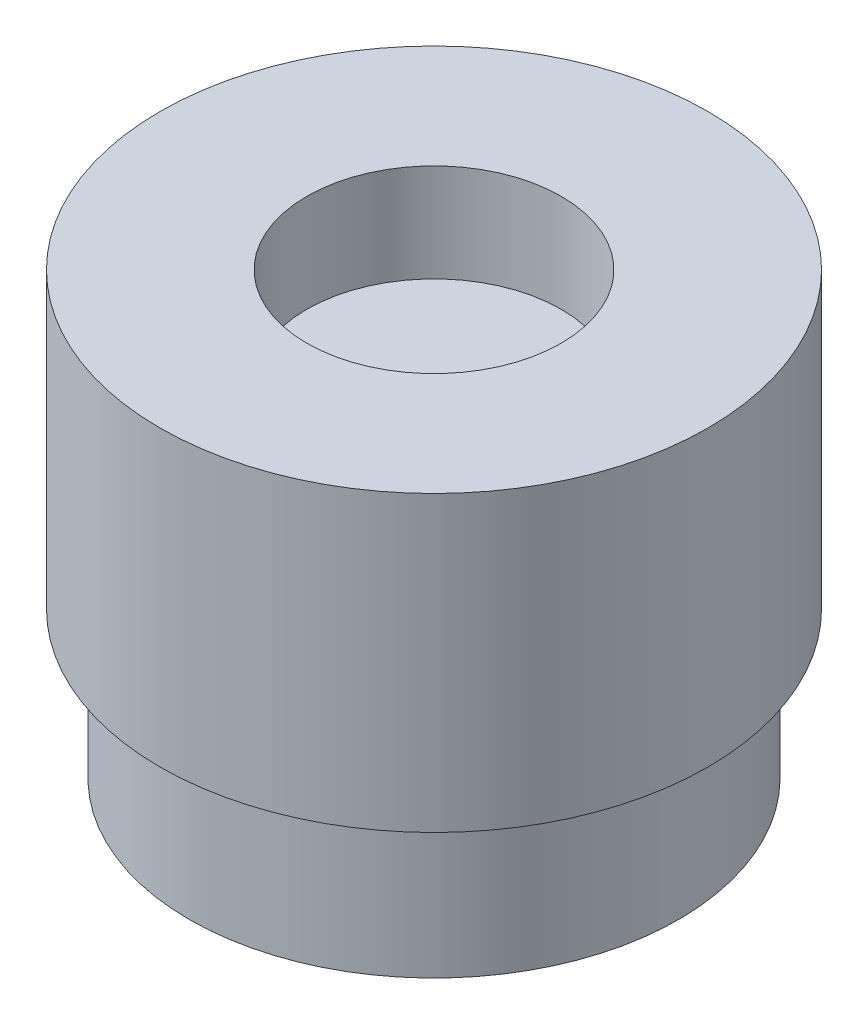
ISO-10303-21;
HEADER;
FILE_DESCRIPTION(('STEP AP214'),'2;1');
FILE_NAME('part.step','',(''),(''),'','','');
FILE_SCHEMA(('AUTOMOTIVE_DESIGN { 1 0 10303 214 1 1 1 1 }'));
ENDSEC;
DATA;
#1=APPLICATION_CONTEXT('core data for automotive mechanical design processes');
#2=APPLICATION_PROTOCOL_DEFINITION('international standard','automotive_design',2000,#1);
#3=PRODUCT_CONTEXT('',#1,'mechanical');
#4=PRODUCT('Part','Part','',(#3));
#5=PRODUCT_RELATED_PRODUCT_CATEGORY('part','',(#4));
#6=PRODUCT_DEFINITION_FORMATION('','',#4);
#7=PRODUCT_DEFINITION_CONTEXT('part definition',#1,'design');
#8=PRODUCT_DEFINITION('design','',#6,#7);
#9=PRODUCT_DEFINITION_SHAPE('','',#8);
#10=(LENGTH_UNIT() NAMED_UNIT(*) SI_UNIT(.MILLI.,.METRE.));
#11=(NAMED_UNIT(*) PLANE_ANGLE_UNIT() SI_UNIT($,.RADIAN.));
#12=(NAMED_UNIT(*) SI_UNIT($,.STERADIAN.) SOLID_ANGLE_UNIT());
#13=UNCERTAINTY_MEASURE_WITH_UNIT(LENGTH_MEASURE(1.E-05),#10,'distance_accuracy_value','');
#14=(GEOMETRIC_REPRESENTATION_CONTEXT(3) GLOBAL_UNCERTAINTY_ASSIGNED_CONTEXT((#13)) GLOBAL_UNIT_ASSIGNED_CONTEXT((#10,
#11,#12)) REPRESENTATION_CONTEXT('',''));
#15=CARTESIAN_POINT('',(0.,0.,0.));
#16=DIRECTION('',(0.,0.,1.));
#17=DIRECTION('',(1.,0.,0.));
#18=AXIS2_PLACEMENT_3D('',#15,#16,#17);
#19=CARTESIAN_POINT('',(0.,3.,0.));
#20=DIRECTION('',(0.,1.,0.));
#21=DIRECTION('',(0.,0.,1.));
#22=AXIS2_PLACEMENT_3D('',#19,#20,#21);
#23=PLANE('',#22);
#24=CARTESIAN_POINT('',(0.,3.,0.));
#25=DIRECTION('',(0.,1.,0.));
#26=DIRECTION('',(0.,0.,1.));
#27=AXIS2_PLACEMENT_3D('',#24,#25,#26);
#28=CIRCLE('',#27,5.);
#29=CARTESIAN_POINT('',(0.,3.,5.));
#30=VERTEX_POINT('',#29);
#31=EDGE_CURVE('E116',#30,#30,#28,.T.);
#32=ORIENTED_EDGE('',*,*,#31,.T.);
#33=EDGE_LOOP('',(#32));
#34=FACE_BOUND('',#33,.T.);
#35=DIRECTION('',(0.,0.,1.));
#36=VECTOR('',#35,1.);
#37=CARTESIAN_POINT('',(1.,3.,-3.61420807370024));
#38=LINE('',#37,#36);
#39=CARTESIAN_POINT('',(1.,3.,-4.38748219369606));
#40=VERTEX_POINT('',#39);
#41=CARTESIAN_POINT('',(1.,3.,-3.61420807370024));
#42=VERTEX_POINT('',#41);
#43=EDGE_CURVE('E149',#40,#42,#38,.T.);
#44=ORIENTED_EDGE('',*,*,#43,.F.);
#45=CARTESIAN_POINT('',(0.,3.,0.));
#46=DIRECTION('',(0.,1.,0.));
#47=DIRECTION('',(0.,0.,1.));
#48=AXIS2_PLACEMENT_3D('',#45,#46,#47);
#49=CIRCLE('',#48,4.5);
#50=CARTESIAN_POINT('',(-1.,3.,-4.38748219369606));
#51=VERTEX_POINT('',#50);
#52=EDGE_CURVE('E100',#51,#40,#49,.T.);
#53=ORIENTED_EDGE('',*,*,#52,.F.);
#54=DIRECTION('',(0.,0.,-1.));
#55=VECTOR('',#54,1.);
#56=CARTESIAN_POINT('',(-1.,3.,-3.61420807370024));
#57=LINE('',#56,#55);
#58=CARTESIAN_POINT('',(-1.,3.,-3.61420807370024));
#59=VERTEX_POINT('',#58);
#60=EDGE_CURVE('E151',#59,#51,#57,.T.);
#61=ORIENTED_EDGE('',*,*,#60,.F.);
#62=CARTESIAN_POINT('',(0.,3.,0.));
#63=DIRECTION('',(0.,1.,0.));
#64=DIRECTION('',(0.,0.,1.));
#65=AXIS2_PLACEMENT_3D('',#62,#63,#64);
#66=CIRCLE('',#65,3.75);
#67=EDGE_CURVE('E52',#42,#59,#66,.F.);
#68=ORIENTED_EDGE('',*,*,#67,.F.);
#69=EDGE_LOOP('',(#44,#53,#61,#68));
#70=FACE_BOUND('',#69,.T.);
#71=CARTESIAN_POINT('',(0.,3.,0.));
#72=DIRECTION('',(0.,1.,0.));
#73=DIRECTION('',(0.,0.,1.));
#74=AXIS2_PLACEMENT_3D('',#71,#72,#73);
#75=CIRCLE('',#74,1.5);
#76=CARTESIAN_POINT('',(0.,3.,1.5));
#77=VERTEX_POINT('',#76);
#78=EDGE_CURVE('E110',#77,#77,#75,.T.);
#79=ORIENTED_EDGE('',*,*,#78,.F.);
#80=EDGE_LOOP('',(#79));
#81=FACE_BOUND('',#80,.T.);
#82=ADVANCED_FACE('F44',(#34,#70,#81),#23,.T.);
#83=CARTESIAN_POINT('',(0.,0.,0.));
#84=DIRECTION('',(0.,1.,0.));
#85=DIRECTION('',(0.,0.,1.));
#86=AXIS2_PLACEMENT_3D('',#83,#84,#85);
#87=PLANE('',#86);
#88=CARTESIAN_POINT('',(0.,0.,0.));
#89=DIRECTION('',(0.,1.,0.));
#90=DIRECTION('',(0.,0.,1.));
#91=AXIS2_PLACEMENT_3D('',#88,#89,#90);
#92=CIRCLE('',#91,5.);
#93=CARTESIAN_POINT('',(0.,0.,5.));
#94=VERTEX_POINT('',#93);
#95=EDGE_CURVE('E113',#94,#94,#92,.T.);
#96=ORIENTED_EDGE('',*,*,#95,.F.);
#97=EDGE_LOOP('',(#96));
#98=FACE_BOUND('',#97,.T.);
#99=CARTESIAN_POINT('',(0.,0.,0.));
#100=DIRECTION('',(0.,1.,0.));
#101=DIRECTION('',(0.,0.,1.));
#102=AXIS2_PLACEMENT_3D('',#99,#100,#101);
#103=CIRCLE('',#102,1.5);
#104=CARTESIAN_POINT('',(0.,0.,1.5));
#105=VERTEX_POINT('',#104);
#106=EDGE_CURVE('E102',#105,#105,#103,.T.);
#107=ORIENTED_EDGE('',*,*,#106,.T.);
#108=EDGE_LOOP('',(#107));
#109=FACE_BOUND('',#108,.T.);
#110=ADVANCED_FACE('F123',(#98,#109),#87,.F.);
#111=CARTESIAN_POINT('',(0.,3.,0.));
#112=DIRECTION('',(0.,-1.,0.));
#113=DIRECTION('',(0.,0.,-1.));
#114=AXIS2_PLACEMENT_3D('',#111,#112,#113);
#115=CYLINDRICAL_SURFACE('',#114,5.);
#116=ORIENTED_EDGE('',*,*,#31,.F.);
#117=EDGE_LOOP('',(#116));
#118=FACE_BOUND('',#117,.T.);
#119=ORIENTED_EDGE('',*,*,#95,.T.);
#120=EDGE_LOOP('',(#119));
#121=FACE_BOUND('',#120,.T.);
#122=ADVANCED_FACE('F46',(#118,#121),#115,.T.);
#123=CARTESIAN_POINT('',(0.,3.,0.));
#124=DIRECTION('',(0.,-1.,0.));
#125=DIRECTION('',(0.,0.,-1.));
#126=AXIS2_PLACEMENT_3D('',#123,#124,#125);
#127=CYLINDRICAL_SURFACE('',#126,1.5);
#128=ORIENTED_EDGE('',*,*,#78,.T.);
#129=EDGE_LOOP('',(#128));
#130=FACE_BOUND('',#129,.T.);
#131=ORIENTED_EDGE('',*,*,#106,.F.);
#132=EDGE_LOOP('',(#131));
#133=FACE_BOUND('',#132,.T.);
#134=ADVANCED_FACE('F128',(#130,#133),#127,.F.);
#135=CARTESIAN_POINT('',(0.,5.5,0.));
#136=DIRECTION('',(0.,-1.,0.));
#137=DIRECTION('',(0.,0.,-1.));
#138=AXIS2_PLACEMENT_3D('',#135,#136,#137);
#139=CYLINDRICAL_SURFACE('',#138,3.75);
#140=DIRECTION('',(0.,1.,0.));
#141=VECTOR('',#140,1.);
#142=CARTESIAN_POINT('',(1.,0.566808831390843,-3.61420807370024));
#143=LINE('',#142,#141);
#144=CARTESIAN_POINT('',(1.,5.5,-3.61420807370024));
#145=VERTEX_POINT('',#144);
#146=EDGE_CURVE('E96',#42,#145,#143,.T.);
#147=ORIENTED_EDGE('',*,*,#146,.F.);
#148=ORIENTED_EDGE('',*,*,#67,.T.);
#149=DIRECTION('',(0.,1.,0.));
#150=VECTOR('',#149,1.);
#151=CARTESIAN_POINT('',(-1.,0.566808831390843,-3.61420807370024));
#152=LINE('',#151,#150);
#153=CARTESIAN_POINT('',(-1.,5.5,-3.61420807370024));
#154=VERTEX_POINT('',#153);
#155=EDGE_CURVE('E84',#59,#154,#152,.T.);
#156=ORIENTED_EDGE('',*,*,#155,.T.);
#157=CARTESIAN_POINT('',(0.,5.5,0.));
#158=DIRECTION('',(0.,1.,0.));
#159=DIRECTION('',(0.,0.,1.));
#160=AXIS2_PLACEMENT_3D('',#157,#158,#159);
#161=CIRCLE('',#160,3.75);
#162=EDGE_CURVE('E94',#154,#145,#161,.T.);
#163=ORIENTED_EDGE('',*,*,#162,.T.);
#164=EDGE_LOOP('',(#147,#148,#156,#163));
#165=FACE_BOUND('',#164,.T.);
#166=ADVANCED_FACE('F93',(#165),#139,.F.);
#167=CARTESIAN_POINT('',(0.,5.5,0.));
#168=DIRECTION('',(0.,-1.,0.));
#169=DIRECTION('',(0.,0.,-1.));
#170=AXIS2_PLACEMENT_3D('',#167,#168,#169);
#171=CYLINDRICAL_SURFACE('',#170,4.5);
#172=ORIENTED_EDGE('',*,*,#52,.T.);
#173=DIRECTION('',(0.,-1.,0.));
#174=VECTOR('',#173,1.);
#175=CARTESIAN_POINT('',(1.,5.5,-4.38748219369606));
#176=LINE('',#175,#174);
#177=CARTESIAN_POINT('',(1.,5.5,-4.38748219369606));
#178=VERTEX_POINT('',#177);
#179=EDGE_CURVE('E105',#40,#178,#176,.F.);
#180=ORIENTED_EDGE('',*,*,#179,.T.);
#181=CARTESIAN_POINT('',(0.,5.5,0.));
#182=DIRECTION('',(0.,1.,0.));
#183=DIRECTION('',(0.,0.,1.));
#184=AXIS2_PLACEMENT_3D('',#181,#182,#183);
#185=CIRCLE('',#184,4.5);
#186=CARTESIAN_POINT('',(-1.,5.5,-4.38748219369606));
#187=VERTEX_POINT('',#186);
#188=EDGE_CURVE('E99',#187,#178,#185,.T.);
#189=ORIENTED_EDGE('',*,*,#188,.F.);
#190=DIRECTION('',(0.,-1.,0.));
#191=VECTOR('',#190,1.);
#192=CARTESIAN_POINT('',(-1.,5.5,-4.38748219369606));
#193=LINE('',#192,#191);
#194=EDGE_CURVE('E58',#187,#51,#193,.T.);
#195=ORIENTED_EDGE('',*,*,#194,.T.);
#196=EDGE_LOOP('',(#172,#180,#189,#195));
#197=FACE_BOUND('',#196,.T.);
#198=ADVANCED_FACE('F136',(#197),#171,.T.);
#199=CARTESIAN_POINT('',(0.,5.5,0.));
#200=DIRECTION('',(0.,1.,0.));
#201=DIRECTION('',(0.,0.,1.));
#202=AXIS2_PLACEMENT_3D('',#199,#200,#201);
#203=PLANE('',#202);
#204=DIRECTION('',(0.,0.,-1.));
#205=VECTOR('',#204,1.);
#206=CARTESIAN_POINT('',(1.,5.5,-3.61420807370024));
#207=LINE('',#206,#205);
#208=EDGE_CURVE('E66',#145,#178,#207,.T.);
#209=ORIENTED_EDGE('',*,*,#208,.F.);
#210=ORIENTED_EDGE('',*,*,#162,.F.);
#211=DIRECTION('',(0.,0.,1.));
#212=VECTOR('',#211,1.);
#213=CARTESIAN_POINT('',(-1.,5.5,0.));
#214=LINE('',#213,#212);
#215=EDGE_CURVE('E12',#187,#154,#214,.T.);
#216=ORIENTED_EDGE('',*,*,#215,.F.);
#217=ORIENTED_EDGE('',*,*,#188,.T.);
#218=EDGE_LOOP('',(#209,#210,#216,#217));
#219=FACE_BOUND('',#218,.T.);
#220=ADVANCED_FACE('F98',(#219),#203,.T.);
#221=CARTESIAN_POINT('',(1.,0.566808831390843,-3.61420807370024));
#222=DIRECTION('',(1.,0.,0.));
#223=DIRECTION('',(0.,0.,-1.));
#224=AXIS2_PLACEMENT_3D('',#221,#222,#223);
#225=PLANE('',#224);
#226=ORIENTED_EDGE('',*,*,#43,.T.);
#227=ORIENTED_EDGE('',*,*,#146,.T.);
#228=ORIENTED_EDGE('',*,*,#208,.T.);
#229=ORIENTED_EDGE('',*,*,#179,.F.);
#230=EDGE_LOOP('',(#226,#227,#228,#229));
#231=FACE_BOUND('',#230,.T.);
#232=ADVANCED_FACE('F157',(#231),#225,.F.);
#233=CARTESIAN_POINT('',(-1.,0.566808831390843,-3.61420807370024));
#234=DIRECTION('',(-1.,0.,0.));
#235=DIRECTION('',(0.,0.,1.));
#236=AXIS2_PLACEMENT_3D('',#233,#234,#235);
#237=PLANE('',#236);
#238=ORIENTED_EDGE('',*,*,#215,.T.);
#239=ORIENTED_EDGE('',*,*,#155,.F.);
#240=ORIENTED_EDGE('',*,*,#60,.T.);
#241=ORIENTED_EDGE('',*,*,#194,.F.);
#242=EDGE_LOOP('',(#238,#239,#240,#241));
#243=FACE_BOUND('',#242,.T.);
#244=ADVANCED_FACE('F83',(#243),#237,.F.);
#245=CLOSED_SHELL('',(#82,#110,#122,#134,#166,#198,#220,#232,#244));
#246=MANIFOLD_SOLID_BREP('B2',#245);
#247=CARTESIAN_POINT('',(0.,6.,0.));
#248=DIRECTION('',(0.,-1.,0.));
#249=DIRECTION('',(0.,0.,-1.));
#250=AXIS2_PLACEMENT_3D('',#247,#248,#249);
#251=CYLINDRICAL_SURFACE('',#250,4.6);
#252=CARTESIAN_POINT('',(0.,3.,0.));
#253=DIRECTION('',(0.,1.,0.));
#254=DIRECTION('',(0.,0.,1.));
#255=AXIS2_PLACEMENT_3D('',#252,#253,#254);
#256=CIRCLE('',#255,4.6);
#257=CARTESIAN_POINT('',(-0.95,3.,-4.50083325618713));
#258=VERTEX_POINT('',#257);
#259=CARTESIAN_POINT('',(0.95,3.,-4.50083325618713));
#260=VERTEX_POINT('',#259);
#261=EDGE_CURVE('E285',#258,#260,#256,.T.);
#262=ORIENTED_EDGE('',*,*,#261,.F.);
#263=DIRECTION('',(0.,-1.,0.));
#264=VECTOR('',#263,1.);
#265=CARTESIAN_POINT('',(-0.95,6.,-4.50083325618713));
#266=LINE('',#265,#264);
#267=CARTESIAN_POINT('',(-0.95,6.,-4.50083325618713));
#268=VERTEX_POINT('',#267);
#269=EDGE_CURVE('E229',#268,#258,#266,.T.);
#270=ORIENTED_EDGE('',*,*,#269,.F.);
#271=CARTESIAN_POINT('',(0.,6.,0.));
#272=DIRECTION('',(0.,1.,0.));
#273=DIRECTION('',(0.,0.,1.));
#274=AXIS2_PLACEMENT_3D('',#271,#272,#273);
#275=CIRCLE('',#274,4.6);
#276=CARTESIAN_POINT('',(0.95,6.,-4.50083325618713));
#277=VERTEX_POINT('',#276);
#278=EDGE_CURVE('E264',#268,#277,#275,.T.);
#279=ORIENTED_EDGE('',*,*,#278,.T.);
#280=DIRECTION('',(0.,-1.,0.));
#281=VECTOR('',#280,1.);
#282=CARTESIAN_POINT('',(0.95,6.,-4.50083325618713));
#283=LINE('',#282,#281);
#284=EDGE_CURVE('E258',#277,#260,#283,.T.);
#285=ORIENTED_EDGE('',*,*,#284,.T.);
#286=EDGE_LOOP('',(#262,#270,#279,#285));
#287=FACE_BOUND('',#286,.T.);
#288=ADVANCED_FACE('F221',(#287),#251,.F.);
#289=CARTESIAN_POINT('',(-0.949999999999998,6.,0.));
#290=DIRECTION('',(-1.,0.,0.));
#291=DIRECTION('',(0.,0.,1.));
#292=AXIS2_PLACEMENT_3D('',#289,#290,#291);
#293=PLANE('',#292);
#294=DIRECTION('',(0.,0.,-1.));
#295=VECTOR('',#294,1.);
#296=CARTESIAN_POINT('',(-0.949999999999998,3.,0.));
#297=LINE('',#296,#295);
#298=CARTESIAN_POINT('',(-0.95,3.,-3.75));
#299=VERTEX_POINT('',#298);
#300=EDGE_CURVE('E287',#299,#258,#297,.T.);
#301=ORIENTED_EDGE('',*,*,#300,.F.);
#302=DIRECTION('',(0.,-1.,0.));
#303=VECTOR('',#302,1.);
#304=CARTESIAN_POINT('',(-0.95,6.,-3.75));
#305=LINE('',#304,#303);
#306=CARTESIAN_POINT('',(-0.95,6.,-3.75));
#307=VERTEX_POINT('',#306);
#308=EDGE_CURVE('E296',#307,#299,#305,.T.);
#309=ORIENTED_EDGE('',*,*,#308,.F.);
#310=DIRECTION('',(0.,0.,-1.));
#311=VECTOR('',#310,1.);
#312=CARTESIAN_POINT('',(-0.949999999999998,6.,0.));
#313=LINE('',#312,#311);
#314=EDGE_CURVE('E268',#307,#268,#313,.T.);
#315=ORIENTED_EDGE('',*,*,#314,.T.);
#316=ORIENTED_EDGE('',*,*,#269,.T.);
#317=EDGE_LOOP('',(#301,#309,#315,#316));
#318=FACE_BOUND('',#317,.T.);
#319=ADVANCED_FACE('F299',(#318),#293,.T.);
#320=CARTESIAN_POINT('',(0.,6.,-3.75));
#321=DIRECTION('',(0.,0.,-1.));
#322=DIRECTION('',(-1.,0.,0.));
#323=AXIS2_PLACEMENT_3D('',#320,#321,#322);
#324=PLANE('',#323);
#325=DIRECTION('',(1.,0.,0.));
#326=VECTOR('',#325,1.);
#327=CARTESIAN_POINT('',(0.,3.,-3.75));
#328=LINE('',#327,#326);
#329=CARTESIAN_POINT('',(0.95,3.,-3.75));
#330=VERTEX_POINT('',#329);
#331=EDGE_CURVE('E252',#299,#330,#328,.T.);
#332=ORIENTED_EDGE('',*,*,#331,.T.);
#333=DIRECTION('',(0.,-1.,0.));
#334=VECTOR('',#333,1.);
#335=CARTESIAN_POINT('',(0.95,6.,-3.75));
#336=LINE('',#335,#334);
#337=CARTESIAN_POINT('',(0.95,6.,-3.75));
#338=VERTEX_POINT('',#337);
#339=EDGE_CURVE('E237',#338,#330,#336,.T.);
#340=ORIENTED_EDGE('',*,*,#339,.F.);
#341=DIRECTION('',(1.,0.,0.));
#342=VECTOR('',#341,1.);
#343=CARTESIAN_POINT('',(0.,6.,-3.75));
#344=LINE('',#343,#342);
#345=EDGE_CURVE('E280',#307,#338,#344,.T.);
#346=ORIENTED_EDGE('',*,*,#345,.F.);
#347=ORIENTED_EDGE('',*,*,#308,.T.);
#348=EDGE_LOOP('',(#332,#340,#346,#347));
#349=FACE_BOUND('',#348,.T.);
#350=ADVANCED_FACE('F338',(#349),#324,.F.);
#351=CARTESIAN_POINT('',(0.95,6.,0.));
#352=DIRECTION('',(-1.,0.,0.));
#353=DIRECTION('',(0.,0.,1.));
#354=AXIS2_PLACEMENT_3D('',#351,#352,#353);
#355=PLANE('',#354);
#356=DIRECTION('',(0.,0.,-1.));
#357=VECTOR('',#356,1.);
#358=CARTESIAN_POINT('',(0.95,3.,0.));
#359=LINE('',#358,#357);
#360=EDGE_CURVE('E276',#330,#260,#359,.T.);
#361=ORIENTED_EDGE('',*,*,#360,.T.);
#362=ORIENTED_EDGE('',*,*,#284,.F.);
#363=DIRECTION('',(0.,0.,-1.));
#364=VECTOR('',#363,1.);
#365=CARTESIAN_POINT('',(0.95,6.,0.));
#366=LINE('',#365,#364);
#367=EDGE_CURVE('E273',#338,#277,#366,.T.);
#368=ORIENTED_EDGE('',*,*,#367,.F.);
#369=ORIENTED_EDGE('',*,*,#339,.T.);
#370=EDGE_LOOP('',(#361,#362,#368,#369));
#371=FACE_BOUND('',#370,.T.);
#372=ADVANCED_FACE('F272',(#371),#355,.F.);
#373=CARTESIAN_POINT('',(0.,6.,0.));
#374=DIRECTION('',(0.,-1.,0.));
#375=DIRECTION('',(0.,0.,-1.));
#376=AXIS2_PLACEMENT_3D('',#373,#374,#375);
#377=CYLINDRICAL_SURFACE('',#376,5.6);
#378=CARTESIAN_POINT('',(0.,3.,0.));
#379=DIRECTION('',(0.,1.,0.));
#380=DIRECTION('',(0.,0.,1.));
#381=AXIS2_PLACEMENT_3D('',#378,#379,#380);
#382=CIRCLE('',#381,5.6);
#383=CARTESIAN_POINT('',(0.,3.,5.6));
#384=VERTEX_POINT('',#383);
#385=EDGE_CURVE('E269',#384,#384,#382,.T.);
#386=ORIENTED_EDGE('',*,*,#385,.T.);
#387=EDGE_LOOP('',(#386));
#388=FACE_BOUND('',#387,.T.);
#389=CARTESIAN_POINT('',(0.,9.,0.));
#390=DIRECTION('',(0.,1.,0.));
#391=DIRECTION('',(0.,0.,1.));
#392=AXIS2_PLACEMENT_3D('',#389,#390,#391);
#393=CIRCLE('',#392,5.6);
#394=CARTESIAN_POINT('',(0.,9.,5.6));
#395=VERTEX_POINT('',#394);
#396=EDGE_CURVE('E288',#395,#395,#393,.T.);
#397=ORIENTED_EDGE('',*,*,#396,.F.);
#398=EDGE_LOOP('',(#397));
#399=FACE_BOUND('',#398,.T.);
#400=ADVANCED_FACE('F304',(#388,#399),#377,.T.);
#401=CARTESIAN_POINT('',(0.,3.,0.));
#402=DIRECTION('',(0.,1.,0.));
#403=DIRECTION('',(0.,0.,1.));
#404=AXIS2_PLACEMENT_3D('',#401,#402,#403);
#405=PLANE('',#404);
#406=ORIENTED_EDGE('',*,*,#261,.T.);
#407=ORIENTED_EDGE('',*,*,#360,.F.);
#408=ORIENTED_EDGE('',*,*,#331,.F.);
#409=ORIENTED_EDGE('',*,*,#300,.T.);
#410=EDGE_LOOP('',(#406,#407,#408,#409));
#411=FACE_BOUND('',#410,.T.);
#412=ORIENTED_EDGE('',*,*,#385,.F.);
#413=EDGE_LOOP('',(#412));
#414=FACE_BOUND('',#413,.T.);
#415=ADVANCED_FACE('F301',(#411,#414),#405,.F.);
#416=CARTESIAN_POINT('',(0.,6.,0.));
#417=DIRECTION('',(0.,1.,0.));
#418=DIRECTION('',(0.,0.,1.));
#419=AXIS2_PLACEMENT_3D('',#416,#417,#418);
#420=PLANE('',#419);
#421=ORIENTED_EDGE('',*,*,#278,.F.);
#422=ORIENTED_EDGE('',*,*,#314,.F.);
#423=ORIENTED_EDGE('',*,*,#345,.T.);
#424=ORIENTED_EDGE('',*,*,#367,.T.);
#425=EDGE_LOOP('',(#421,#422,#423,#424));
#426=FACE_BOUND('',#425,.T.);
#427=ADVANCED_FACE('F279',(#426),#420,.F.);
#428=CARTESIAN_POINT('',(0.,9.,0.));
#429=DIRECTION('',(0.,1.,0.));
#430=DIRECTION('',(0.,0.,1.));
#431=AXIS2_PLACEMENT_3D('',#428,#429,#430);
#432=PLANE('',#431);
#433=ORIENTED_EDGE('',*,*,#396,.T.);
#434=EDGE_LOOP('',(#433));
#435=FACE_BOUND('',#434,.T.);
#436=CARTESIAN_POINT('',(0.,9.,0.));
#437=DIRECTION('',(0.,1.,0.));
#438=DIRECTION('',(0.,0.,1.));
#439=AXIS2_PLACEMENT_3D('',#436,#437,#438);
#440=CIRCLE('',#439,2.6);
#441=CARTESIAN_POINT('',(0.,9.,2.6));
#442=VERTEX_POINT('',#441);
#443=EDGE_CURVE('E314',#442,#442,#440,.T.);
#444=ORIENTED_EDGE('',*,*,#443,.F.);
#445=EDGE_LOOP('',(#444));
#446=FACE_BOUND('',#445,.T.);
#447=ADVANCED_FACE('F323',(#435,#446),#432,.T.);
#448=CARTESIAN_POINT('',(0.,9.,0.));
#449=DIRECTION('',(0.,-1.,0.));
#450=DIRECTION('',(0.,0.,-1.));
#451=AXIS2_PLACEMENT_3D('',#448,#449,#450);
#452=CYLINDRICAL_SURFACE('',#451,2.6);
#453=ORIENTED_EDGE('',*,*,#443,.T.);
#454=EDGE_LOOP('',(#453));
#455=FACE_BOUND('',#454,.T.);
#456=CARTESIAN_POINT('',(0.,7.,0.));
#457=DIRECTION('',(0.,1.,0.));
#458=DIRECTION('',(0.,0.,1.));
#459=AXIS2_PLACEMENT_3D('',#456,#457,#458);
#460=CIRCLE('',#459,2.6);
#461=CARTESIAN_POINT('',(0.,7.,2.6));
#462=VERTEX_POINT('',#461);
#463=EDGE_CURVE('E42',#462,#462,#460,.F.);
#464=ORIENTED_EDGE('',*,*,#463,.T.);
#465=EDGE_LOOP('',(#464));
#466=FACE_BOUND('',#465,.T.);
#467=ADVANCED_FACE('F320',(#455,#466),#452,.F.);
#468=CARTESIAN_POINT('',(0.,7.,0.));
#469=DIRECTION('',(0.,1.,0.));
#470=DIRECTION('',(0.,0.,1.));
#471=AXIS2_PLACEMENT_3D('',#468,#469,#470);
#472=PLANE('',#471);
#473=ORIENTED_EDGE('',*,*,#463,.F.);
#474=EDGE_LOOP('',(#473));
#475=FACE_BOUND('',#474,.T.);
#476=ADVANCED_FACE('F330',(#475),#472,.T.);
#477=CLOSED_SHELL('',(#288,#319,#350,#372,#400,#415,#427,#447,#467,#476));
#478=MANIFOLD_SOLID_BREP('B6',#477);
#479=ADVANCED_BREP_SHAPE_REPRESENTATION('',(#18,#246,#478),#14);
#480=SHAPE_DEFINITION_REPRESENTATION(#9,#479);
ENDSEC;
END-ISO-10303-21;
